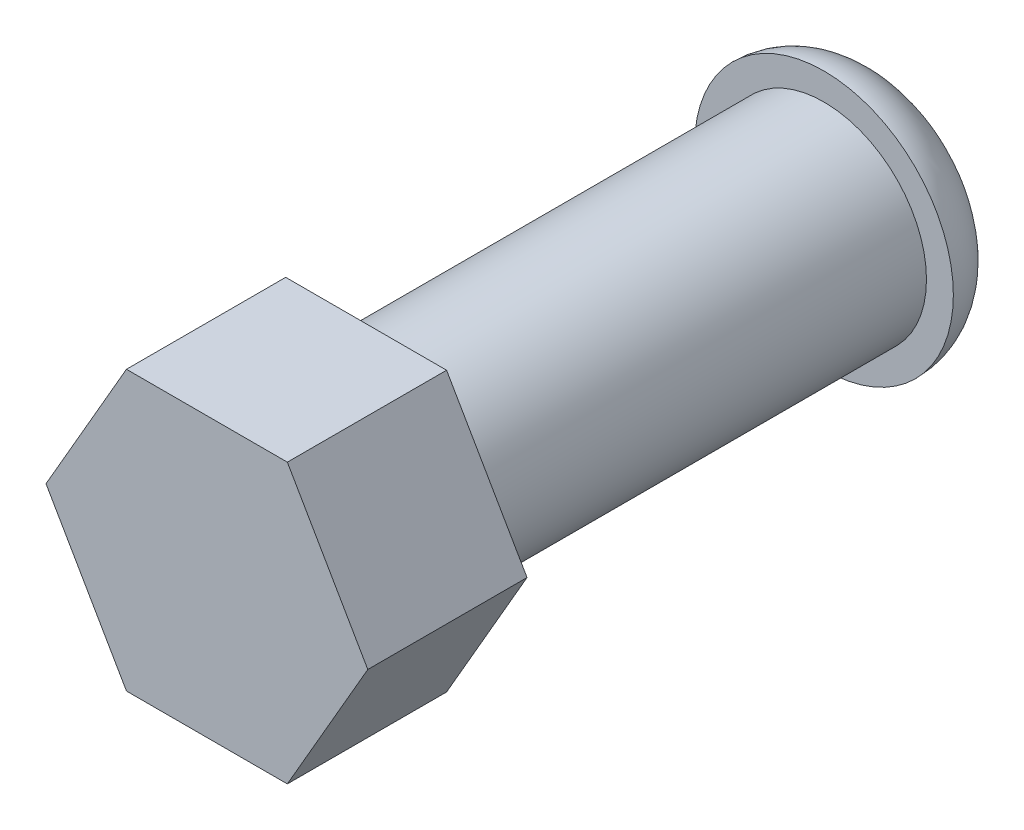
ISO-10303-21;
HEADER;
FILE_DESCRIPTION(('STEP AP214'),'2;1');
FILE_NAME('part.step','',(''),(''),'','','');
FILE_SCHEMA(('AUTOMOTIVE_DESIGN { 1 0 10303 214 1 1 1 1 }'));
ENDSEC;
DATA;
#1=APPLICATION_CONTEXT('core data for automotive mechanical design processes');
#2=APPLICATION_PROTOCOL_DEFINITION('international standard','automotive_design',2000,#1);
#3=PRODUCT_CONTEXT('',#1,'mechanical');
#4=PRODUCT('Part','Part','',(#3));
#5=PRODUCT_RELATED_PRODUCT_CATEGORY('part','',(#4));
#6=PRODUCT_DEFINITION_FORMATION('','',#4);
#7=PRODUCT_DEFINITION_CONTEXT('part definition',#1,'design');
#8=PRODUCT_DEFINITION('design','',#6,#7);
#9=PRODUCT_DEFINITION_SHAPE('','',#8);
#10=(LENGTH_UNIT() NAMED_UNIT(*) SI_UNIT(.MILLI.,.METRE.));
#11=(NAMED_UNIT(*) PLANE_ANGLE_UNIT() SI_UNIT($,.RADIAN.));
#12=(NAMED_UNIT(*) SI_UNIT($,.STERADIAN.) SOLID_ANGLE_UNIT());
#13=UNCERTAINTY_MEASURE_WITH_UNIT(LENGTH_MEASURE(1.E-05),#10,'distance_accuracy_value','');
#14=(GEOMETRIC_REPRESENTATION_CONTEXT(3) GLOBAL_UNCERTAINTY_ASSIGNED_CONTEXT((#13)) GLOBAL_UNIT_ASSIGNED_CONTEXT((#10,
#11,#12)) REPRESENTATION_CONTEXT('',''));
#15=CARTESIAN_POINT('',(0.,0.,0.));
#16=DIRECTION('',(0.,0.,1.));
#17=DIRECTION('',(1.,0.,0.));
#18=AXIS2_PLACEMENT_3D('',#15,#16,#17);
#19=CARTESIAN_POINT('',(0.,0.,23.));
#20=DIRECTION('',(0.,0.,-1.));
#21=DIRECTION('',(-1.,0.,0.));
#22=AXIS2_PLACEMENT_3D('',#19,#20,#21);
#23=CYLINDRICAL_SURFACE('',#22,5.15);
#24=CARTESIAN_POINT('',(0.,0.,23.));
#25=DIRECTION('',(0.,0.,1.));
#26=DIRECTION('',(1.,0.,0.));
#27=AXIS2_PLACEMENT_3D('',#24,#25,#26);
#28=CIRCLE('',#27,5.15);
#29=CARTESIAN_POINT('',(5.15,0.,23.));
#30=VERTEX_POINT('',#29);
#31=EDGE_CURVE('E43',#30,#30,#28,.T.);
#32=ORIENTED_EDGE('',*,*,#31,.F.);
#33=EDGE_LOOP('',(#32));
#34=FACE_BOUND('',#33,.T.);
#35=CARTESIAN_POINT('',(0.,0.,0.));
#36=DIRECTION('',(0.,0.,1.));
#37=DIRECTION('',(1.,0.,0.));
#38=AXIS2_PLACEMENT_3D('',#35,#36,#37);
#39=CIRCLE('',#38,5.15);
#40=CARTESIAN_POINT('',(5.15,0.,0.));
#41=VERTEX_POINT('',#40);
#42=EDGE_CURVE('E124',#41,#41,#39,.T.);
#43=ORIENTED_EDGE('',*,*,#42,.T.);
#44=EDGE_LOOP('',(#43));
#45=FACE_BOUND('',#44,.T.);
#46=ADVANCED_FACE('F34',(#34,#45),#23,.T.);
#47=CARTESIAN_POINT('',(4.04145188432739,-7.00000000000001,31.));
#48=DIRECTION('',(-0.866025403784439,0.5,0.));
#49=DIRECTION('',(-0.5,-0.866025403784439,0.));
#50=AXIS2_PLACEMENT_3D('',#47,#48,#49);
#51=PLANE('',#50);
#52=DIRECTION('',(0.5,0.866025403784439,0.));
#53=VECTOR('',#52,1.);
#54=CARTESIAN_POINT('',(4.04145188432739,-7.00000000000001,23.));
#55=LINE('',#54,#53);
#56=CARTESIAN_POINT('',(4.04145188432739,-7.00000000000001,23.));
#57=VERTEX_POINT('',#56);
#58=CARTESIAN_POINT('',(8.08290376865477,0.,23.));
#59=VERTEX_POINT('',#58);
#60=EDGE_CURVE('E120',#57,#59,#55,.T.);
#61=ORIENTED_EDGE('',*,*,#60,.T.);
#62=DIRECTION('',(0.,0.,-1.));
#63=VECTOR('',#62,1.);
#64=CARTESIAN_POINT('',(8.08290376865477,0.,31.));
#65=LINE('',#64,#63);
#66=CARTESIAN_POINT('',(8.08290376865477,0.,31.));
#67=VERTEX_POINT('',#66);
#68=EDGE_CURVE('E138',#67,#59,#65,.T.);
#69=ORIENTED_EDGE('',*,*,#68,.F.);
#70=DIRECTION('',(0.5,0.866025403784439,0.));
#71=VECTOR('',#70,1.);
#72=CARTESIAN_POINT('',(4.04145188432739,-7.00000000000001,31.));
#73=LINE('',#72,#71);
#74=CARTESIAN_POINT('',(4.04145188432739,-7.00000000000001,31.));
#75=VERTEX_POINT('',#74);
#76=EDGE_CURVE('E131',#75,#67,#73,.T.);
#77=ORIENTED_EDGE('',*,*,#76,.F.);
#78=DIRECTION('',(0.,0.,-1.));
#79=VECTOR('',#78,1.);
#80=CARTESIAN_POINT('',(4.04145188432739,-7.00000000000001,31.));
#81=LINE('',#80,#79);
#82=EDGE_CURVE('E116',#75,#57,#81,.T.);
#83=ORIENTED_EDGE('',*,*,#82,.T.);
#84=EDGE_LOOP('',(#61,#69,#77,#83));
#85=FACE_BOUND('',#84,.T.);
#86=ADVANCED_FACE('F161',(#85),#51,.F.);
#87=CARTESIAN_POINT('',(8.08290376865477,0.,31.));
#88=DIRECTION('',(-0.866025403784439,-0.5,0.));
#89=DIRECTION('',(0.5,-0.866025403784439,0.));
#90=AXIS2_PLACEMENT_3D('',#87,#88,#89);
#91=PLANE('',#90);
#92=DIRECTION('',(-0.5,0.866025403784439,0.));
#93=VECTOR('',#92,1.);
#94=CARTESIAN_POINT('',(8.08290376865477,0.,23.));
#95=LINE('',#94,#93);
#96=CARTESIAN_POINT('',(4.04145188432738,7.00000000000001,23.));
#97=VERTEX_POINT('',#96);
#98=EDGE_CURVE('E123',#59,#97,#95,.T.);
#99=ORIENTED_EDGE('',*,*,#98,.T.);
#100=DIRECTION('',(0.,0.,-1.));
#101=VECTOR('',#100,1.);
#102=CARTESIAN_POINT('',(4.04145188432738,7.00000000000001,31.));
#103=LINE('',#102,#101);
#104=CARTESIAN_POINT('',(4.04145188432738,7.00000000000001,31.));
#105=VERTEX_POINT('',#104);
#106=EDGE_CURVE('E135',#105,#97,#103,.T.);
#107=ORIENTED_EDGE('',*,*,#106,.F.);
#108=DIRECTION('',(-0.5,0.866025403784439,0.));
#109=VECTOR('',#108,1.);
#110=CARTESIAN_POINT('',(8.08290376865477,0.,31.));
#111=LINE('',#110,#109);
#112=EDGE_CURVE('E89',#67,#105,#111,.T.);
#113=ORIENTED_EDGE('',*,*,#112,.F.);
#114=ORIENTED_EDGE('',*,*,#68,.T.);
#115=EDGE_LOOP('',(#99,#107,#113,#114));
#116=FACE_BOUND('',#115,.T.);
#117=ADVANCED_FACE('F153',(#116),#91,.F.);
#118=CARTESIAN_POINT('',(4.04145188432738,7.00000000000001,31.));
#119=DIRECTION('',(0.,-1.,0.));
#120=DIRECTION('',(1.,0.,0.));
#121=AXIS2_PLACEMENT_3D('',#118,#119,#120);
#122=PLANE('',#121);
#123=DIRECTION('',(-1.,0.,0.));
#124=VECTOR('',#123,1.);
#125=CARTESIAN_POINT('',(4.04145188432738,7.00000000000001,23.));
#126=LINE('',#125,#124);
#127=CARTESIAN_POINT('',(-4.04145188432739,7.00000000000001,23.));
#128=VERTEX_POINT('',#127);
#129=EDGE_CURVE('E126',#97,#128,#126,.T.);
#130=ORIENTED_EDGE('',*,*,#129,.T.);
#131=DIRECTION('',(0.,0.,-1.));
#132=VECTOR('',#131,1.);
#133=CARTESIAN_POINT('',(-4.04145188432739,7.00000000000001,31.));
#134=LINE('',#133,#132);
#135=CARTESIAN_POINT('',(-4.04145188432739,7.00000000000001,31.));
#136=VERTEX_POINT('',#135);
#137=EDGE_CURVE('E111',#136,#128,#134,.T.);
#138=ORIENTED_EDGE('',*,*,#137,.F.);
#139=DIRECTION('',(-1.,0.,0.));
#140=VECTOR('',#139,1.);
#141=CARTESIAN_POINT('',(4.04145188432738,7.00000000000001,31.));
#142=LINE('',#141,#140);
#143=EDGE_CURVE('E102',#105,#136,#142,.T.);
#144=ORIENTED_EDGE('',*,*,#143,.F.);
#145=ORIENTED_EDGE('',*,*,#106,.T.);
#146=EDGE_LOOP('',(#130,#138,#144,#145));
#147=FACE_BOUND('',#146,.T.);
#148=ADVANCED_FACE('F156',(#147),#122,.F.);
#149=CARTESIAN_POINT('',(-4.04145188432739,7.00000000000001,31.));
#150=DIRECTION('',(0.866025403784439,-0.5,0.));
#151=DIRECTION('',(0.5,0.866025403784439,0.));
#152=AXIS2_PLACEMENT_3D('',#149,#150,#151);
#153=PLANE('',#152);
#154=DIRECTION('',(-0.5,-0.866025403784439,0.));
#155=VECTOR('',#154,1.);
#156=CARTESIAN_POINT('',(-4.04145188432739,7.00000000000001,23.));
#157=LINE('',#156,#155);
#158=CARTESIAN_POINT('',(-8.08290376865477,0.,23.));
#159=VERTEX_POINT('',#158);
#160=EDGE_CURVE('E110',#128,#159,#157,.T.);
#161=ORIENTED_EDGE('',*,*,#160,.T.);
#162=DIRECTION('',(0.,0.,-1.));
#163=VECTOR('',#162,1.);
#164=CARTESIAN_POINT('',(-8.08290376865477,0.,31.));
#165=LINE('',#164,#163);
#166=CARTESIAN_POINT('',(-8.08290376865477,0.,31.));
#167=VERTEX_POINT('',#166);
#168=EDGE_CURVE('E107',#167,#159,#165,.T.);
#169=ORIENTED_EDGE('',*,*,#168,.F.);
#170=DIRECTION('',(-0.5,-0.866025403784439,0.));
#171=VECTOR('',#170,1.);
#172=CARTESIAN_POINT('',(-4.04145188432739,7.00000000000001,31.));
#173=LINE('',#172,#171);
#174=EDGE_CURVE('E96',#136,#167,#173,.T.);
#175=ORIENTED_EDGE('',*,*,#174,.F.);
#176=ORIENTED_EDGE('',*,*,#137,.T.);
#177=EDGE_LOOP('',(#161,#169,#175,#176));
#178=FACE_BOUND('',#177,.T.);
#179=ADVANCED_FACE('F108',(#178),#153,.F.);
#180=CARTESIAN_POINT('',(-8.08290376865477,0.,31.));
#181=DIRECTION('',(0.866025403784439,0.5,0.));
#182=DIRECTION('',(-0.5,0.866025403784438,0.));
#183=AXIS2_PLACEMENT_3D('',#180,#181,#182);
#184=PLANE('',#183);
#185=DIRECTION('',(0.5,-0.866025403784438,0.));
#186=VECTOR('',#185,1.);
#187=CARTESIAN_POINT('',(-8.08290376865477,0.,23.));
#188=LINE('',#187,#186);
#189=CARTESIAN_POINT('',(-4.04145188432738,-7.00000000000001,23.));
#190=VERTEX_POINT('',#189);
#191=EDGE_CURVE('E74',#159,#190,#188,.T.);
#192=ORIENTED_EDGE('',*,*,#191,.T.);
#193=DIRECTION('',(0.,0.,-1.));
#194=VECTOR('',#193,1.);
#195=CARTESIAN_POINT('',(-4.04145188432738,-7.00000000000001,31.));
#196=LINE('',#195,#194);
#197=CARTESIAN_POINT('',(-4.04145188432738,-7.00000000000001,31.));
#198=VERTEX_POINT('',#197);
#199=EDGE_CURVE('E112',#198,#190,#196,.T.);
#200=ORIENTED_EDGE('',*,*,#199,.F.);
#201=DIRECTION('',(0.5,-0.866025403784438,0.));
#202=VECTOR('',#201,1.);
#203=CARTESIAN_POINT('',(-8.08290376865477,0.,31.));
#204=LINE('',#203,#202);
#205=EDGE_CURVE('E100',#167,#198,#204,.T.);
#206=ORIENTED_EDGE('',*,*,#205,.F.);
#207=ORIENTED_EDGE('',*,*,#168,.T.);
#208=EDGE_LOOP('',(#192,#200,#206,#207));
#209=FACE_BOUND('',#208,.T.);
#210=ADVANCED_FACE('F114',(#209),#184,.F.);
#211=CARTESIAN_POINT('',(-4.04145188432738,-7.00000000000001,31.));
#212=DIRECTION('',(0.,1.,0.));
#213=DIRECTION('',(0.,0.,1.));
#214=AXIS2_PLACEMENT_3D('',#211,#212,#213);
#215=PLANE('',#214);
#216=DIRECTION('',(1.,0.,0.));
#217=VECTOR('',#216,1.);
#218=CARTESIAN_POINT('',(-4.04145188432738,-7.00000000000001,23.));
#219=LINE('',#218,#217);
#220=EDGE_CURVE('E80',#190,#57,#219,.T.);
#221=ORIENTED_EDGE('',*,*,#220,.T.);
#222=ORIENTED_EDGE('',*,*,#82,.F.);
#223=DIRECTION('',(1.,0.,0.));
#224=VECTOR('',#223,1.);
#225=CARTESIAN_POINT('',(-4.04145188432738,-7.00000000000001,31.));
#226=LINE('',#225,#224);
#227=EDGE_CURVE('E51',#198,#75,#226,.T.);
#228=ORIENTED_EDGE('',*,*,#227,.F.);
#229=ORIENTED_EDGE('',*,*,#199,.T.);
#230=EDGE_LOOP('',(#221,#222,#228,#229));
#231=FACE_BOUND('',#230,.T.);
#232=ADVANCED_FACE('F162',(#231),#215,.F.);
#233=CARTESIAN_POINT('',(0.,0.,31.));
#234=DIRECTION('',(0.,0.,1.));
#235=DIRECTION('',(1.,0.,0.));
#236=AXIS2_PLACEMENT_3D('',#233,#234,#235);
#237=PLANE('',#236);
#238=ORIENTED_EDGE('',*,*,#76,.T.);
#239=ORIENTED_EDGE('',*,*,#112,.T.);
#240=ORIENTED_EDGE('',*,*,#143,.T.);
#241=ORIENTED_EDGE('',*,*,#174,.T.);
#242=ORIENTED_EDGE('',*,*,#205,.T.);
#243=ORIENTED_EDGE('',*,*,#227,.T.);
#244=EDGE_LOOP('',(#238,#239,#240,#241,#242,#243));
#245=FACE_BOUND('',#244,.T.);
#246=ADVANCED_FACE('F98',(#245),#237,.T.);
#247=CARTESIAN_POINT('',(0.,0.,23.));
#248=DIRECTION('',(0.,0.,1.));
#249=DIRECTION('',(1.,0.,0.));
#250=AXIS2_PLACEMENT_3D('',#247,#248,#249);
#251=PLANE('',#250);
#252=ORIENTED_EDGE('',*,*,#31,.T.);
#253=EDGE_LOOP('',(#252));
#254=FACE_BOUND('',#253,.T.);
#255=ORIENTED_EDGE('',*,*,#60,.F.);
#256=ORIENTED_EDGE('',*,*,#220,.F.);
#257=ORIENTED_EDGE('',*,*,#191,.F.);
#258=ORIENTED_EDGE('',*,*,#160,.F.);
#259=ORIENTED_EDGE('',*,*,#129,.F.);
#260=ORIENTED_EDGE('',*,*,#98,.F.);
#261=EDGE_LOOP('',(#255,#256,#257,#258,#259,#260));
#262=FACE_BOUND('',#261,.T.);
#263=ADVANCED_FACE('F159',(#254,#262),#251,.F.);
#264=CARTESIAN_POINT('',(0.,0.,-3.));
#265=DIRECTION('',(0.,0.,-1.));
#266=DIRECTION('',(-1.,0.,0.));
#267=AXIS2_PLACEMENT_3D('',#264,#265,#266);
#268=PLANE('',#267);
#269=CARTESIAN_POINT('',(0.,0.,-3.));
#270=DIRECTION('',(0.,0.,-1.));
#271=DIRECTION('',(-1.,0.,0.));
#272=AXIS2_PLACEMENT_3D('',#269,#270,#271);
#273=CIRCLE('',#272,3.5);
#274=CARTESIAN_POINT('',(-3.5,0.,-3.));
#275=VERTEX_POINT('',#274);
#276=EDGE_CURVE('E11',#275,#275,#273,.T.);
#277=ORIENTED_EDGE('',*,*,#276,.T.);
#278=EDGE_LOOP('',(#277));
#279=FACE_BOUND('',#278,.T.);
#280=ADVANCED_FACE('F212',(#279),#268,.T.);
#281=CARTESIAN_POINT('',(0.,0.,0.));
#282=DIRECTION('',(0.,0.,-1.));
#283=DIRECTION('',(-1.,0.,0.));
#284=AXIS2_PLACEMENT_3D('',#281,#282,#283);
#285=PLANE('',#284);
#286=ORIENTED_EDGE('',*,*,#42,.F.);
#287=EDGE_LOOP('',(#286));
#288=FACE_BOUND('',#287,.T.);
#289=CARTESIAN_POINT('',(0.,0.,0.));
#290=DIRECTION('',(0.,0.,-1.));
#291=DIRECTION('',(-1.,0.,0.));
#292=AXIS2_PLACEMENT_3D('',#289,#290,#291);
#293=CIRCLE('',#292,6.5);
#294=CARTESIAN_POINT('',(-6.5,0.,0.));
#295=VERTEX_POINT('',#294);
#296=EDGE_CURVE('E142',#295,#295,#293,.T.);
#297=ORIENTED_EDGE('',*,*,#296,.F.);
#298=EDGE_LOOP('',(#297));
#299=FACE_BOUND('',#298,.T.);
#300=ADVANCED_FACE('F219',(#288,#299),#285,.F.);
#301=CARTESIAN_POINT('',(0.,0.,0.));
#302=DIRECTION('',(0.,0.,-1.));
#303=DIRECTION('',(-1.,0.,0.));
#304=AXIS2_PLACEMENT_3D('',#301,#302,#303);
#305=TOROIDAL_SURFACE('',#304,3.5,3.);
#306=ORIENTED_EDGE('',*,*,#296,.T.);
#307=EDGE_LOOP('',(#306));
#308=FACE_BOUND('',#307,.T.);
#309=ORIENTED_EDGE('',*,*,#276,.F.);
#310=EDGE_LOOP('',(#309));
#311=FACE_BOUND('',#310,.T.);
#312=ADVANCED_FACE('F36',(#308,#311),#305,.T.);
#313=CLOSED_SHELL('',(#46,#86,#117,#148,#179,#210,#232,#246,#263,#280,#300,#312));
#314=MANIFOLD_SOLID_BREP('B2',#313);
#315=ADVANCED_BREP_SHAPE_REPRESENTATION('',(#18,#314),#14);
#316=SHAPE_DEFINITION_REPRESENTATION(#9,#315);
ENDSEC;
END-ISO-10303-21;
